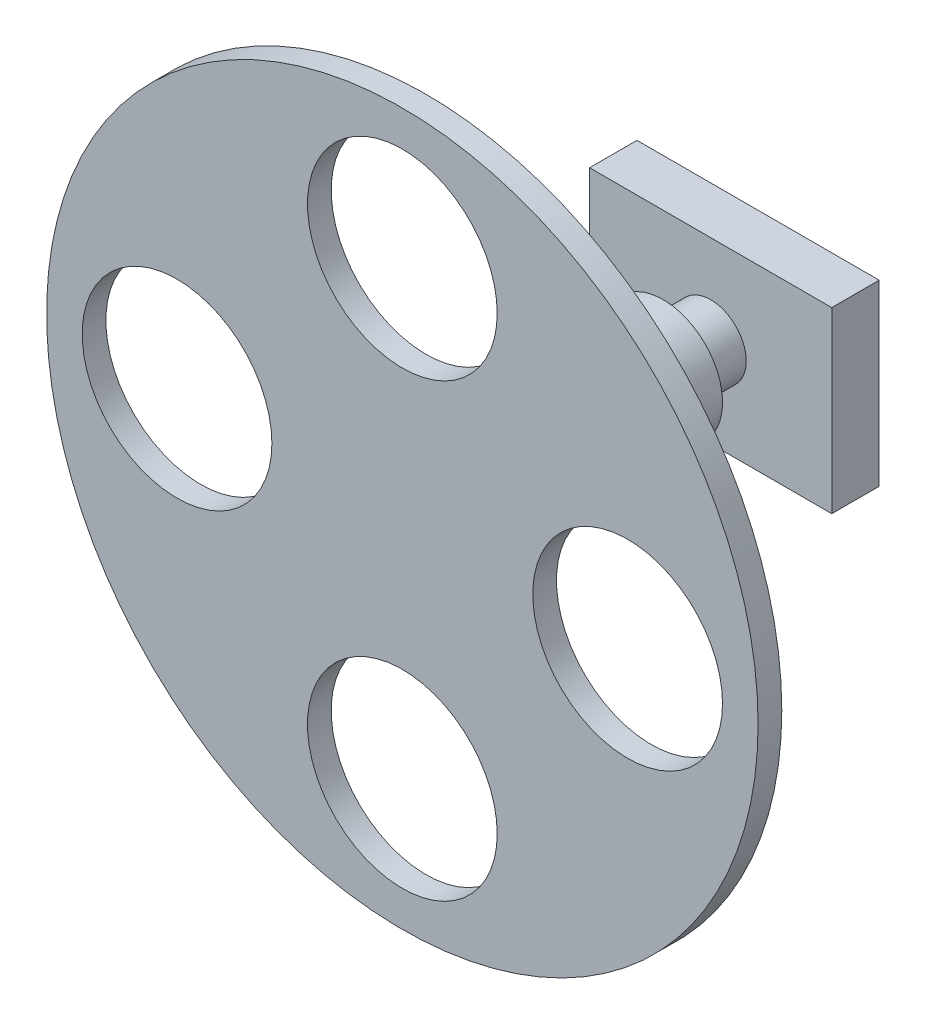
ISO-10303-21;
HEADER;
FILE_DESCRIPTION(('STEP AP214'),'2;1');
FILE_NAME('part.step','',(''),(''),'','','');
FILE_SCHEMA(('AUTOMOTIVE_DESIGN { 1 0 10303 214 1 1 1 1 }'));
ENDSEC;
DATA;
#1=APPLICATION_CONTEXT('core data for automotive mechanical design processes');
#2=APPLICATION_PROTOCOL_DEFINITION('international standard','automotive_design',2000,#1);
#3=PRODUCT_CONTEXT('',#1,'mechanical');
#4=PRODUCT('Part','Part','',(#3));
#5=PRODUCT_RELATED_PRODUCT_CATEGORY('part','',(#4));
#6=PRODUCT_DEFINITION_FORMATION('','',#4);
#7=PRODUCT_DEFINITION_CONTEXT('part definition',#1,'design');
#8=PRODUCT_DEFINITION('design','',#6,#7);
#9=PRODUCT_DEFINITION_SHAPE('','',#8);
#10=(LENGTH_UNIT() NAMED_UNIT(*) SI_UNIT(.MILLI.,.METRE.));
#11=(NAMED_UNIT(*) PLANE_ANGLE_UNIT() SI_UNIT($,.RADIAN.));
#12=(NAMED_UNIT(*) SI_UNIT($,.STERADIAN.) SOLID_ANGLE_UNIT());
#13=UNCERTAINTY_MEASURE_WITH_UNIT(LENGTH_MEASURE(1.E-05),#10,'distance_accuracy_value','');
#14=(GEOMETRIC_REPRESENTATION_CONTEXT(3) GLOBAL_UNCERTAINTY_ASSIGNED_CONTEXT((#13)) GLOBAL_UNIT_ASSIGNED_CONTEXT((#10,
#11,#12)) REPRESENTATION_CONTEXT('',''));
#15=CARTESIAN_POINT('',(0.,0.,0.));
#16=DIRECTION('',(0.,0.,1.));
#17=DIRECTION('',(1.,0.,0.));
#18=AXIS2_PLACEMENT_3D('',#15,#16,#17);
#19=CARTESIAN_POINT('',(0.,0.,10.));
#20=DIRECTION('',(0.,0.,1.));
#21=DIRECTION('',(1.,0.,0.));
#22=AXIS2_PLACEMENT_3D('',#19,#20,#21);
#23=PLANE('',#22);
#24=CARTESIAN_POINT('',(3.95638335447234E-12,-95.,10.));
#25=DIRECTION('',(0.,0.,1.));
#26=DIRECTION('',(1.,0.,0.));
#27=AXIS2_PLACEMENT_3D('',#24,#25,#26);
#28=CIRCLE('',#27,40.);
#29=CARTESIAN_POINT('',(40.000000000004,-95.,10.));
#30=VERTEX_POINT('',#29);
#31=EDGE_CURVE('E132',#30,#30,#28,.T.);
#32=ORIENTED_EDGE('',*,*,#31,.F.);
#33=EDGE_LOOP('',(#32));
#34=FACE_BOUND('',#33,.T.);
#35=CARTESIAN_POINT('',(0.,95.,10.));
#36=DIRECTION('',(0.,0.,1.));
#37=DIRECTION('',(1.,0.,0.));
#38=AXIS2_PLACEMENT_3D('',#35,#36,#37);
#39=CIRCLE('',#38,40.);
#40=CARTESIAN_POINT('',(40.,95.,10.));
#41=VERTEX_POINT('',#40);
#42=EDGE_CURVE('E144',#41,#41,#39,.T.);
#43=ORIENTED_EDGE('',*,*,#42,.F.);
#44=EDGE_LOOP('',(#43));
#45=FACE_BOUND('',#44,.T.);
#46=CARTESIAN_POINT('',(0.,0.,10.));
#47=DIRECTION('',(0.,0.,1.));
#48=DIRECTION('',(1.,0.,0.));
#49=AXIS2_PLACEMENT_3D('',#46,#47,#48);
#50=CIRCLE('',#49,150.);
#51=CARTESIAN_POINT('',(150.,0.,10.));
#52=VERTEX_POINT('',#51);
#53=EDGE_CURVE('E125',#52,#52,#50,.T.);
#54=ORIENTED_EDGE('',*,*,#53,.T.);
#55=EDGE_LOOP('',(#54));
#56=FACE_BOUND('',#55,.T.);
#57=CARTESIAN_POINT('',(95.000000000002,1.97819167723617E-12,10.));
#58=DIRECTION('',(0.,0.,1.));
#59=DIRECTION('',(1.,0.,0.));
#60=AXIS2_PLACEMENT_3D('',#57,#58,#59);
#61=CIRCLE('',#60,40.);
#62=CARTESIAN_POINT('',(135.000000000002,1.97819167723617E-12,10.));
#63=VERTEX_POINT('',#62);
#64=EDGE_CURVE('E138',#63,#63,#61,.T.);
#65=ORIENTED_EDGE('',*,*,#64,.F.);
#66=EDGE_LOOP('',(#65));
#67=FACE_BOUND('',#66,.T.);
#68=CARTESIAN_POINT('',(-94.999999999998,-1.98982582182807E-12,10.));
#69=DIRECTION('',(0.,0.,1.));
#70=DIRECTION('',(1.,0.,0.));
#71=AXIS2_PLACEMENT_3D('',#68,#69,#70);
#72=CIRCLE('',#71,40.);
#73=CARTESIAN_POINT('',(-54.999999999998,-1.98982582182807E-12,10.));
#74=VERTEX_POINT('',#73);
#75=EDGE_CURVE('E126',#74,#74,#72,.T.);
#76=ORIENTED_EDGE('',*,*,#75,.F.);
#77=EDGE_LOOP('',(#76));
#78=FACE_BOUND('',#77,.T.);
#79=ADVANCED_FACE('F37',(#34,#45,#56,#67,#78),#23,.T.);
#80=CARTESIAN_POINT('',(0.,0.,0.));
#81=DIRECTION('',(0.,0.,1.));
#82=DIRECTION('',(1.,0.,0.));
#83=AXIS2_PLACEMENT_3D('',#80,#81,#82);
#84=PLANE('',#83);
#85=CARTESIAN_POINT('',(0.,0.,0.));
#86=DIRECTION('',(0.,0.,-1.));
#87=DIRECTION('',(-1.,0.,0.));
#88=AXIS2_PLACEMENT_3D('',#85,#86,#87);
#89=CIRCLE('',#88,25.);
#90=CARTESIAN_POINT('',(-25.,0.,0.));
#91=VERTEX_POINT('',#90);
#92=EDGE_CURVE('E47',#91,#91,#89,.T.);
#93=ORIENTED_EDGE('',*,*,#92,.F.);
#94=EDGE_LOOP('',(#93));
#95=FACE_BOUND('',#94,.T.);
#96=CARTESIAN_POINT('',(0.,0.,0.));
#97=DIRECTION('',(0.,0.,1.));
#98=DIRECTION('',(1.,0.,0.));
#99=AXIS2_PLACEMENT_3D('',#96,#97,#98);
#100=CIRCLE('',#99,150.);
#101=CARTESIAN_POINT('',(150.,0.,0.));
#102=VERTEX_POINT('',#101);
#103=EDGE_CURVE('E41',#102,#102,#100,.T.);
#104=ORIENTED_EDGE('',*,*,#103,.F.);
#105=EDGE_LOOP('',(#104));
#106=FACE_BOUND('',#105,.T.);
#107=CARTESIAN_POINT('',(0.,95.,0.));
#108=DIRECTION('',(0.,0.,1.));
#109=DIRECTION('',(1.,0.,0.));
#110=AXIS2_PLACEMENT_3D('',#107,#108,#109);
#111=CIRCLE('',#110,40.);
#112=CARTESIAN_POINT('',(40.,95.,0.));
#113=VERTEX_POINT('',#112);
#114=EDGE_CURVE('E141',#113,#113,#111,.T.);
#115=ORIENTED_EDGE('',*,*,#114,.T.);
#116=EDGE_LOOP('',(#115));
#117=FACE_BOUND('',#116,.T.);
#118=CARTESIAN_POINT('',(95.000000000002,1.97819167723617E-12,0.));
#119=DIRECTION('',(0.,0.,1.));
#120=DIRECTION('',(1.,0.,0.));
#121=AXIS2_PLACEMENT_3D('',#118,#119,#120);
#122=CIRCLE('',#121,40.);
#123=CARTESIAN_POINT('',(135.000000000002,1.97819167723617E-12,0.));
#124=VERTEX_POINT('',#123);
#125=EDGE_CURVE('E135',#124,#124,#122,.T.);
#126=ORIENTED_EDGE('',*,*,#125,.T.);
#127=EDGE_LOOP('',(#126));
#128=FACE_BOUND('',#127,.T.);
#129=CARTESIAN_POINT('',(3.95638335447234E-12,-95.,0.));
#130=DIRECTION('',(0.,0.,1.));
#131=DIRECTION('',(1.,0.,0.));
#132=AXIS2_PLACEMENT_3D('',#129,#130,#131);
#133=CIRCLE('',#132,40.);
#134=CARTESIAN_POINT('',(40.000000000004,-95.,0.));
#135=VERTEX_POINT('',#134);
#136=EDGE_CURVE('E129',#135,#135,#133,.T.);
#137=ORIENTED_EDGE('',*,*,#136,.T.);
#138=EDGE_LOOP('',(#137));
#139=FACE_BOUND('',#138,.T.);
#140=CARTESIAN_POINT('',(-94.999999999998,-1.98982582182807E-12,0.));
#141=DIRECTION('',(0.,0.,1.));
#142=DIRECTION('',(1.,0.,0.));
#143=AXIS2_PLACEMENT_3D('',#140,#141,#142);
#144=CIRCLE('',#143,40.);
#145=CARTESIAN_POINT('',(-54.999999999998,-1.98982582182807E-12,0.));
#146=VERTEX_POINT('',#145);
#147=EDGE_CURVE('E122',#146,#146,#144,.T.);
#148=ORIENTED_EDGE('',*,*,#147,.T.);
#149=EDGE_LOOP('',(#148));
#150=FACE_BOUND('',#149,.T.);
#151=ADVANCED_FACE('F155',(#95,#106,#117,#128,#139,#150),#84,.F.);
#152=CARTESIAN_POINT('',(0.,0.,10.));
#153=DIRECTION('',(0.,0.,-1.));
#154=DIRECTION('',(-1.,0.,0.));
#155=AXIS2_PLACEMENT_3D('',#152,#153,#154);
#156=CYLINDRICAL_SURFACE('',#155,150.);
#157=ORIENTED_EDGE('',*,*,#53,.F.);
#158=EDGE_LOOP('',(#157));
#159=FACE_BOUND('',#158,.T.);
#160=ORIENTED_EDGE('',*,*,#103,.T.);
#161=EDGE_LOOP('',(#160));
#162=FACE_BOUND('',#161,.T.);
#163=ADVANCED_FACE('F39',(#159,#162),#156,.T.);
#164=CARTESIAN_POINT('',(0.,95.,10.));
#165=DIRECTION('',(0.,0.,-1.));
#166=DIRECTION('',(-1.,0.,0.));
#167=AXIS2_PLACEMENT_3D('',#164,#165,#166);
#168=CYLINDRICAL_SURFACE('',#167,40.);
#169=ORIENTED_EDGE('',*,*,#42,.T.);
#170=EDGE_LOOP('',(#169));
#171=FACE_BOUND('',#170,.T.);
#172=ORIENTED_EDGE('',*,*,#114,.F.);
#173=EDGE_LOOP('',(#172));
#174=FACE_BOUND('',#173,.T.);
#175=ADVANCED_FACE('F191',(#171,#174),#168,.F.);
#176=CARTESIAN_POINT('',(95.000000000002,1.97819167723617E-12,10.));
#177=DIRECTION('',(0.,0.,-1.));
#178=DIRECTION('',(-1.,0.,0.));
#179=AXIS2_PLACEMENT_3D('',#176,#177,#178);
#180=CYLINDRICAL_SURFACE('',#179,40.);
#181=ORIENTED_EDGE('',*,*,#64,.T.);
#182=EDGE_LOOP('',(#181));
#183=FACE_BOUND('',#182,.T.);
#184=ORIENTED_EDGE('',*,*,#125,.F.);
#185=EDGE_LOOP('',(#184));
#186=FACE_BOUND('',#185,.T.);
#187=ADVANCED_FACE('F180',(#183,#186),#180,.F.);
#188=CARTESIAN_POINT('',(3.95638335447234E-12,-95.,10.));
#189=DIRECTION('',(0.,0.,-1.));
#190=DIRECTION('',(-1.,0.,0.));
#191=AXIS2_PLACEMENT_3D('',#188,#189,#190);
#192=CYLINDRICAL_SURFACE('',#191,40.);
#193=ORIENTED_EDGE('',*,*,#31,.T.);
#194=EDGE_LOOP('',(#193));
#195=FACE_BOUND('',#194,.T.);
#196=ORIENTED_EDGE('',*,*,#136,.F.);
#197=EDGE_LOOP('',(#196));
#198=FACE_BOUND('',#197,.T.);
#199=ADVANCED_FACE('F170',(#195,#198),#192,.F.);
#200=CARTESIAN_POINT('',(-94.999999999998,-1.98982582182807E-12,10.));
#201=DIRECTION('',(0.,0.,-1.));
#202=DIRECTION('',(-1.,0.,0.));
#203=AXIS2_PLACEMENT_3D('',#200,#201,#202);
#204=CYLINDRICAL_SURFACE('',#203,40.);
#205=ORIENTED_EDGE('',*,*,#75,.T.);
#206=EDGE_LOOP('',(#205));
#207=FACE_BOUND('',#206,.T.);
#208=ORIENTED_EDGE('',*,*,#147,.F.);
#209=EDGE_LOOP('',(#208));
#210=FACE_BOUND('',#209,.T.);
#211=ADVANCED_FACE('F167',(#207,#210),#204,.F.);
#212=CARTESIAN_POINT('',(0.,0.,-100.));
#213=DIRECTION('',(0.,0.,1.));
#214=DIRECTION('',(1.,0.,0.));
#215=AXIS2_PLACEMENT_3D('',#212,#213,#214);
#216=CYLINDRICAL_SURFACE('',#215,25.);
#217=CARTESIAN_POINT('',(0.,0.,-100.));
#218=DIRECTION('',(0.,0.,-1.));
#219=DIRECTION('',(-1.,0.,0.));
#220=AXIS2_PLACEMENT_3D('',#217,#218,#219);
#221=CIRCLE('',#220,25.);
#222=CARTESIAN_POINT('',(-25.,0.,-100.));
#223=VERTEX_POINT('',#222);
#224=EDGE_CURVE('E118',#223,#223,#221,.T.);
#225=ORIENTED_EDGE('',*,*,#224,.F.);
#226=EDGE_LOOP('',(#225));
#227=FACE_BOUND('',#226,.T.);
#228=ORIENTED_EDGE('',*,*,#92,.T.);
#229=EDGE_LOOP('',(#228));
#230=FACE_BOUND('',#229,.T.);
#231=ADVANCED_FACE('F169',(#227,#230),#216,.T.);
#232=CARTESIAN_POINT('',(0.,0.,-100.));
#233=DIRECTION('',(0.,0.,-1.));
#234=DIRECTION('',(-1.,0.,0.));
#235=AXIS2_PLACEMENT_3D('',#232,#233,#234);
#236=PLANE('',#235);
#237=CARTESIAN_POINT('',(0.,0.,-100.));
#238=DIRECTION('',(0.,0.,-1.));
#239=DIRECTION('',(-1.,0.,0.));
#240=AXIS2_PLACEMENT_3D('',#237,#238,#239);
#241=CIRCLE('',#240,15.);
#242=CARTESIAN_POINT('',(-15.,0.,-100.));
#243=VERTEX_POINT('',#242);
#244=EDGE_CURVE('E11',#243,#243,#241,.T.);
#245=ORIENTED_EDGE('',*,*,#244,.F.);
#246=EDGE_LOOP('',(#245));
#247=FACE_BOUND('',#246,.T.);
#248=ORIENTED_EDGE('',*,*,#224,.T.);
#249=EDGE_LOOP('',(#248));
#250=FACE_BOUND('',#249,.T.);
#251=ADVANCED_FACE('F177',(#247,#250),#236,.T.);
#252=CARTESIAN_POINT('',(0.,0.,-120.));
#253=DIRECTION('',(0.,0.,1.));
#254=DIRECTION('',(1.,0.,0.));
#255=AXIS2_PLACEMENT_3D('',#252,#253,#254);
#256=CYLINDRICAL_SURFACE('',#255,15.);
#257=CARTESIAN_POINT('',(0.,0.,-120.));
#258=DIRECTION('',(0.,0.,-1.));
#259=DIRECTION('',(-1.,0.,0.));
#260=AXIS2_PLACEMENT_3D('',#257,#258,#259);
#261=CIRCLE('',#260,15.);
#262=CARTESIAN_POINT('',(-15.,0.,-120.));
#263=VERTEX_POINT('',#262);
#264=EDGE_CURVE('E116',#263,#263,#261,.T.);
#265=ORIENTED_EDGE('',*,*,#264,.F.);
#266=EDGE_LOOP('',(#265));
#267=FACE_BOUND('',#266,.T.);
#268=ORIENTED_EDGE('',*,*,#244,.T.);
#269=EDGE_LOOP('',(#268));
#270=FACE_BOUND('',#269,.T.);
#271=ADVANCED_FACE('F238',(#267,#270),#256,.T.);
#272=CARTESIAN_POINT('',(51.0627059819185,-37.6363497357916,-140.));
#273=DIRECTION('',(-1.,0.,0.));
#274=DIRECTION('',(0.,0.,1.));
#275=AXIS2_PLACEMENT_3D('',#272,#273,#274);
#276=PLANE('',#275);
#277=DIRECTION('',(0.,-1.,0.));
#278=VECTOR('',#277,1.);
#279=CARTESIAN_POINT('',(51.0627059819185,-37.6363497357916,-120.));
#280=LINE('',#279,#278);
#281=CARTESIAN_POINT('',(51.0627059819185,37.6363497357916,-120.));
#282=VERTEX_POINT('',#281);
#283=CARTESIAN_POINT('',(51.0627059819185,-37.6363497357916,-120.));
#284=VERTEX_POINT('',#283);
#285=EDGE_CURVE('E107',#282,#284,#280,.T.);
#286=ORIENTED_EDGE('',*,*,#285,.T.);
#287=DIRECTION('',(0.,0.,1.));
#288=VECTOR('',#287,1.);
#289=CARTESIAN_POINT('',(51.0627059819185,-37.6363497357916,-140.));
#290=LINE('',#289,#288);
#291=CARTESIAN_POINT('',(51.0627059819185,-37.6363497357916,-140.));
#292=VERTEX_POINT('',#291);
#293=EDGE_CURVE('E98',#292,#284,#290,.T.);
#294=ORIENTED_EDGE('',*,*,#293,.F.);
#295=DIRECTION('',(0.,-1.,0.));
#296=VECTOR('',#295,1.);
#297=CARTESIAN_POINT('',(51.0627059819185,-37.6363497357916,-140.));
#298=LINE('',#297,#296);
#299=CARTESIAN_POINT('',(51.0627059819185,37.6363497357916,-140.));
#300=VERTEX_POINT('',#299);
#301=EDGE_CURVE('E92',#300,#292,#298,.T.);
#302=ORIENTED_EDGE('',*,*,#301,.F.);
#303=DIRECTION('',(0.,0.,1.));
#304=VECTOR('',#303,1.);
#305=CARTESIAN_POINT('',(51.0627059819185,37.6363497357916,-140.));
#306=LINE('',#305,#304);
#307=EDGE_CURVE('E103',#300,#282,#306,.T.);
#308=ORIENTED_EDGE('',*,*,#307,.T.);
#309=EDGE_LOOP('',(#286,#294,#302,#308));
#310=FACE_BOUND('',#309,.T.);
#311=ADVANCED_FACE('F248',(#310),#276,.F.);
#312=CARTESIAN_POINT('',(-51.0627059819185,-37.6363497357916,-140.));
#313=DIRECTION('',(0.,1.,0.));
#314=DIRECTION('',(0.,0.,1.));
#315=AXIS2_PLACEMENT_3D('',#312,#313,#314);
#316=PLANE('',#315);
#317=DIRECTION('',(-1.,0.,0.));
#318=VECTOR('',#317,1.);
#319=CARTESIAN_POINT('',(-51.0627059819185,-37.6363497357916,-120.));
#320=LINE('',#319,#318);
#321=CARTESIAN_POINT('',(-51.0627059819185,-37.6363497357916,-120.));
#322=VERTEX_POINT('',#321);
#323=EDGE_CURVE('E97',#284,#322,#320,.T.);
#324=ORIENTED_EDGE('',*,*,#323,.T.);
#325=DIRECTION('',(0.,0.,1.));
#326=VECTOR('',#325,1.);
#327=CARTESIAN_POINT('',(-51.0627059819185,-37.6363497357916,-140.));
#328=LINE('',#327,#326);
#329=CARTESIAN_POINT('',(-51.0627059819185,-37.6363497357916,-140.));
#330=VERTEX_POINT('',#329);
#331=EDGE_CURVE('E95',#330,#322,#328,.T.);
#332=ORIENTED_EDGE('',*,*,#331,.F.);
#333=DIRECTION('',(-1.,0.,0.));
#334=VECTOR('',#333,1.);
#335=CARTESIAN_POINT('',(-51.0627059819185,-37.6363497357916,-140.));
#336=LINE('',#335,#334);
#337=EDGE_CURVE('E87',#292,#330,#336,.T.);
#338=ORIENTED_EDGE('',*,*,#337,.F.);
#339=ORIENTED_EDGE('',*,*,#293,.T.);
#340=EDGE_LOOP('',(#324,#332,#338,#339));
#341=FACE_BOUND('',#340,.T.);
#342=ADVANCED_FACE('F96',(#341),#316,.F.);
#343=CARTESIAN_POINT('',(-51.0627059819185,-37.6363497357916,-140.));
#344=DIRECTION('',(1.,0.,0.));
#345=DIRECTION('',(0.,0.,-1.));
#346=AXIS2_PLACEMENT_3D('',#343,#344,#345);
#347=PLANE('',#346);
#348=DIRECTION('',(0.,1.,0.));
#349=VECTOR('',#348,1.);
#350=CARTESIAN_POINT('',(-51.0627059819185,-37.6363497357916,-120.));
#351=LINE('',#350,#349);
#352=CARTESIAN_POINT('',(-51.0627059819185,37.6363497357916,-120.));
#353=VERTEX_POINT('',#352);
#354=EDGE_CURVE('E73',#322,#353,#351,.T.);
#355=ORIENTED_EDGE('',*,*,#354,.T.);
#356=DIRECTION('',(0.,0.,1.));
#357=VECTOR('',#356,1.);
#358=CARTESIAN_POINT('',(-51.0627059819185,37.6363497357916,-140.));
#359=LINE('',#358,#357);
#360=CARTESIAN_POINT('',(-51.0627059819185,37.6363497357916,-140.));
#361=VERTEX_POINT('',#360);
#362=EDGE_CURVE('E99',#361,#353,#359,.T.);
#363=ORIENTED_EDGE('',*,*,#362,.F.);
#364=DIRECTION('',(0.,1.,0.));
#365=VECTOR('',#364,1.);
#366=CARTESIAN_POINT('',(-51.0627059819185,-37.6363497357916,-140.));
#367=LINE('',#366,#365);
#368=EDGE_CURVE('E90',#330,#361,#367,.T.);
#369=ORIENTED_EDGE('',*,*,#368,.F.);
#370=ORIENTED_EDGE('',*,*,#331,.T.);
#371=EDGE_LOOP('',(#355,#363,#369,#370));
#372=FACE_BOUND('',#371,.T.);
#373=ADVANCED_FACE('F101',(#372),#347,.F.);
#374=CARTESIAN_POINT('',(-51.0627059819185,37.6363497357916,-140.));
#375=DIRECTION('',(0.,-1.,0.));
#376=DIRECTION('',(0.,0.,-1.));
#377=AXIS2_PLACEMENT_3D('',#374,#375,#376);
#378=PLANE('',#377);
#379=DIRECTION('',(1.,0.,0.));
#380=VECTOR('',#379,1.);
#381=CARTESIAN_POINT('',(-51.0627059819185,37.6363497357916,-120.));
#382=LINE('',#381,#380);
#383=EDGE_CURVE('E79',#353,#282,#382,.T.);
#384=ORIENTED_EDGE('',*,*,#383,.T.);
#385=ORIENTED_EDGE('',*,*,#307,.F.);
#386=DIRECTION('',(1.,0.,0.));
#387=VECTOR('',#386,1.);
#388=CARTESIAN_POINT('',(-51.0627059819185,37.6363497357916,-140.));
#389=LINE('',#388,#387);
#390=EDGE_CURVE('E56',#361,#300,#389,.T.);
#391=ORIENTED_EDGE('',*,*,#390,.F.);
#392=ORIENTED_EDGE('',*,*,#362,.T.);
#393=EDGE_LOOP('',(#384,#385,#391,#392));
#394=FACE_BOUND('',#393,.T.);
#395=ADVANCED_FACE('F275',(#394),#378,.F.);
#396=CARTESIAN_POINT('',(0.,0.,-140.));
#397=DIRECTION('',(0.,0.,-1.));
#398=DIRECTION('',(-1.,0.,0.));
#399=AXIS2_PLACEMENT_3D('',#396,#397,#398);
#400=PLANE('',#399);
#401=ORIENTED_EDGE('',*,*,#301,.T.);
#402=ORIENTED_EDGE('',*,*,#337,.T.);
#403=ORIENTED_EDGE('',*,*,#368,.T.);
#404=ORIENTED_EDGE('',*,*,#390,.T.);
#405=EDGE_LOOP('',(#401,#402,#403,#404));
#406=FACE_BOUND('',#405,.T.);
#407=ADVANCED_FACE('F88',(#406),#400,.T.);
#408=CARTESIAN_POINT('',(0.,0.,-120.));
#409=DIRECTION('',(0.,0.,-1.));
#410=DIRECTION('',(-1.,0.,0.));
#411=AXIS2_PLACEMENT_3D('',#408,#409,#410);
#412=PLANE('',#411);
#413=ORIENTED_EDGE('',*,*,#264,.T.);
#414=EDGE_LOOP('',(#413));
#415=FACE_BOUND('',#414,.T.);
#416=ORIENTED_EDGE('',*,*,#285,.F.);
#417=ORIENTED_EDGE('',*,*,#383,.F.);
#418=ORIENTED_EDGE('',*,*,#354,.F.);
#419=ORIENTED_EDGE('',*,*,#323,.F.);
#420=EDGE_LOOP('',(#416,#417,#418,#419));
#421=FACE_BOUND('',#420,.T.);
#422=ADVANCED_FACE('F292',(#415,#421),#412,.F.);
#423=CLOSED_SHELL('',(#79,#151,#163,#175,#187,#199,#211,#231,#251,#271,#311,#342,#373,#395,#407,#422));
#424=MANIFOLD_SOLID_BREP('B2',#423);
#425=ADVANCED_BREP_SHAPE_REPRESENTATION('',(#18,#424),#14);
#426=SHAPE_DEFINITION_REPRESENTATION(#9,#425);
ENDSEC;
END-ISO-10303-21;
